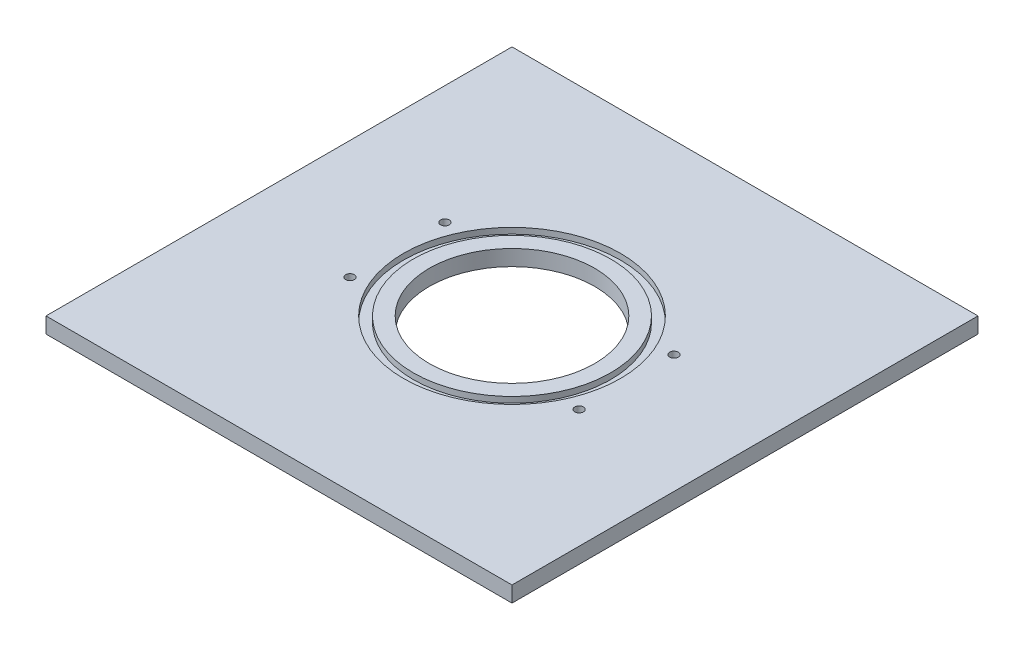
ISO-10303-21;
HEADER;
FILE_DESCRIPTION(('STEP AP214'),'2;1');
FILE_NAME('part.step','',(''),(''),'','','');
FILE_SCHEMA(('AUTOMOTIVE_DESIGN { 1 0 10303 214 1 1 1 1 }'));
ENDSEC;
DATA;
#1=APPLICATION_CONTEXT('core data for automotive mechanical design processes');
#2=APPLICATION_PROTOCOL_DEFINITION('international standard','automotive_design',2000,#1);
#3=PRODUCT_CONTEXT('',#1,'mechanical');
#4=PRODUCT('Part','Part','',(#3));
#5=PRODUCT_RELATED_PRODUCT_CATEGORY('part','',(#4));
#6=PRODUCT_DEFINITION_FORMATION('','',#4);
#7=PRODUCT_DEFINITION_CONTEXT('part definition',#1,'design');
#8=PRODUCT_DEFINITION('design','',#6,#7);
#9=PRODUCT_DEFINITION_SHAPE('','',#8);
#10=(LENGTH_UNIT() NAMED_UNIT(*) SI_UNIT(.MILLI.,.METRE.));
#11=(NAMED_UNIT(*) PLANE_ANGLE_UNIT() SI_UNIT($,.RADIAN.));
#12=(NAMED_UNIT(*) SI_UNIT($,.STERADIAN.) SOLID_ANGLE_UNIT());
#13=UNCERTAINTY_MEASURE_WITH_UNIT(LENGTH_MEASURE(1.E-05),#10,'distance_accuracy_value','');
#14=(GEOMETRIC_REPRESENTATION_CONTEXT(3) GLOBAL_UNCERTAINTY_ASSIGNED_CONTEXT((#13)) GLOBAL_UNIT_ASSIGNED_CONTEXT((#10,
#11,#12)) REPRESENTATION_CONTEXT('',''));
#15=CARTESIAN_POINT('',(0.,0.,0.));
#16=DIRECTION('',(0.,0.,1.));
#17=DIRECTION('',(1.,0.,0.));
#18=AXIS2_PLACEMENT_3D('',#15,#16,#17);
#19=CARTESIAN_POINT('',(0.,7.62,0.));
#20=DIRECTION('',(0.,1.,0.));
#21=DIRECTION('',(0.,0.,1.));
#22=AXIS2_PLACEMENT_3D('',#19,#20,#21);
#23=PLANE('',#22);
#24=CARTESIAN_POINT('',(0.,7.62,0.));
#25=DIRECTION('',(0.,1.,0.));
#26=DIRECTION('',(0.,0.,1.));
#27=AXIS2_PLACEMENT_3D('',#24,#25,#26);
#28=CIRCLE('',#27,40.);
#29=CARTESIAN_POINT('',(0.,7.62,-40.));
#30=VERTEX_POINT('',#29);
#31=EDGE_CURVE('E112',#30,#30,#28,.T.);
#32=ORIENTED_EDGE('',*,*,#31,.F.);
#33=EDGE_LOOP('',(#32));
#34=FACE_BOUND('',#33,.T.);
#35=CARTESIAN_POINT('',(0.,7.62,0.));
#36=DIRECTION('',(0.,1.,0.));
#37=DIRECTION('',(0.,0.,1.));
#38=AXIS2_PLACEMENT_3D('',#35,#36,#37);
#39=CIRCLE('',#38,47.7502);
#40=CARTESIAN_POINT('',(0.,7.62,47.7502));
#41=VERTEX_POINT('',#40);
#42=EDGE_CURVE('E129',#41,#41,#39,.T.);
#43=ORIENTED_EDGE('',*,*,#42,.T.);
#44=EDGE_LOOP('',(#43));
#45=FACE_BOUND('',#44,.T.);
#46=ADVANCED_FACE('F44',(#34,#45),#23,.T.);
#47=CARTESIAN_POINT('',(112.776,7.62,0.));
#48=DIRECTION('',(1.,0.,0.));
#49=DIRECTION('',(0.,0.,-1.));
#50=AXIS2_PLACEMENT_3D('',#47,#48,#49);
#51=PLANE('',#50);
#52=DIRECTION('',(0.,0.,1.));
#53=VECTOR('',#52,1.);
#54=CARTESIAN_POINT('',(112.776,0.,0.));
#55=LINE('',#54,#53);
#56=CARTESIAN_POINT('',(112.776,0.,-112.776));
#57=VERTEX_POINT('',#56);
#58=CARTESIAN_POINT('',(112.776,0.,112.776));
#59=VERTEX_POINT('',#58);
#60=EDGE_CURVE('E115',#57,#59,#55,.T.);
#61=ORIENTED_EDGE('',*,*,#60,.F.);
#62=DIRECTION('',(0.,-1.,0.));
#63=VECTOR('',#62,1.);
#64=CARTESIAN_POINT('',(112.776,7.62,-112.776));
#65=LINE('',#64,#63);
#66=CARTESIAN_POINT('',(112.776,7.62,-112.776));
#67=VERTEX_POINT('',#66);
#68=EDGE_CURVE('E12',#67,#57,#65,.T.);
#69=ORIENTED_EDGE('',*,*,#68,.F.);
#70=DIRECTION('',(0.,0.,1.));
#71=VECTOR('',#70,1.);
#72=CARTESIAN_POINT('',(112.776,7.62,0.));
#73=LINE('',#72,#71);
#74=CARTESIAN_POINT('',(112.776,7.62,112.776));
#75=VERTEX_POINT('',#74);
#76=EDGE_CURVE('E105',#67,#75,#73,.T.);
#77=ORIENTED_EDGE('',*,*,#76,.T.);
#78=DIRECTION('',(0.,-1.,0.));
#79=VECTOR('',#78,1.);
#80=CARTESIAN_POINT('',(112.776,7.62,112.776));
#81=LINE('',#80,#79);
#82=EDGE_CURVE('E85',#75,#59,#81,.T.);
#83=ORIENTED_EDGE('',*,*,#82,.T.);
#84=EDGE_LOOP('',(#61,#69,#77,#83));
#85=FACE_BOUND('',#84,.T.);
#86=ADVANCED_FACE('F46',(#85),#51,.T.);
#87=CARTESIAN_POINT('',(0.,7.62,-112.776));
#88=DIRECTION('',(0.,0.,-1.));
#89=DIRECTION('',(-1.,0.,0.));
#90=AXIS2_PLACEMENT_3D('',#87,#88,#89);
#91=PLANE('',#90);
#92=DIRECTION('',(1.,0.,0.));
#93=VECTOR('',#92,1.);
#94=CARTESIAN_POINT('',(0.,0.,-112.776));
#95=LINE('',#94,#93);
#96=CARTESIAN_POINT('',(-112.776,0.,-112.776));
#97=VERTEX_POINT('',#96);
#98=EDGE_CURVE('E98',#97,#57,#95,.T.);
#99=ORIENTED_EDGE('',*,*,#98,.F.);
#100=DIRECTION('',(0.,-1.,0.));
#101=VECTOR('',#100,1.);
#102=CARTESIAN_POINT('',(-112.776,7.62,-112.776));
#103=LINE('',#102,#101);
#104=CARTESIAN_POINT('',(-112.776,7.62,-112.776));
#105=VERTEX_POINT('',#104);
#106=EDGE_CURVE('E54',#105,#97,#103,.T.);
#107=ORIENTED_EDGE('',*,*,#106,.F.);
#108=DIRECTION('',(1.,0.,0.));
#109=VECTOR('',#108,1.);
#110=CARTESIAN_POINT('',(0.,7.62,-112.776));
#111=LINE('',#110,#109);
#112=EDGE_CURVE('E96',#105,#67,#111,.T.);
#113=ORIENTED_EDGE('',*,*,#112,.T.);
#114=ORIENTED_EDGE('',*,*,#68,.T.);
#115=EDGE_LOOP('',(#99,#107,#113,#114));
#116=FACE_BOUND('',#115,.T.);
#117=ADVANCED_FACE('F94',(#116),#91,.T.);
#118=CARTESIAN_POINT('',(-112.776,7.62,0.));
#119=DIRECTION('',(1.,0.,0.));
#120=DIRECTION('',(0.,0.,-1.));
#121=AXIS2_PLACEMENT_3D('',#118,#119,#120);
#122=PLANE('',#121);
#123=DIRECTION('',(0.,0.,1.));
#124=VECTOR('',#123,1.);
#125=CARTESIAN_POINT('',(-112.776,0.,0.));
#126=LINE('',#125,#124);
#127=CARTESIAN_POINT('',(-112.776,0.,112.776));
#128=VERTEX_POINT('',#127);
#129=EDGE_CURVE('E78',#97,#128,#126,.T.);
#130=ORIENTED_EDGE('',*,*,#129,.T.);
#131=DIRECTION('',(0.,-1.,0.));
#132=VECTOR('',#131,1.);
#133=CARTESIAN_POINT('',(-112.776,7.62,112.776));
#134=LINE('',#133,#132);
#135=CARTESIAN_POINT('',(-112.776,7.62,112.776));
#136=VERTEX_POINT('',#135);
#137=EDGE_CURVE('E99',#136,#128,#134,.T.);
#138=ORIENTED_EDGE('',*,*,#137,.F.);
#139=DIRECTION('',(0.,0.,1.));
#140=VECTOR('',#139,1.);
#141=CARTESIAN_POINT('',(-112.776,7.62,0.));
#142=LINE('',#141,#140);
#143=EDGE_CURVE('E101',#105,#136,#142,.T.);
#144=ORIENTED_EDGE('',*,*,#143,.F.);
#145=ORIENTED_EDGE('',*,*,#106,.T.);
#146=EDGE_LOOP('',(#130,#138,#144,#145));
#147=FACE_BOUND('',#146,.T.);
#148=ADVANCED_FACE('F102',(#147),#122,.F.);
#149=CARTESIAN_POINT('',(0.,7.62,112.776));
#150=DIRECTION('',(0.,0.,-1.));
#151=DIRECTION('',(-1.,0.,0.));
#152=AXIS2_PLACEMENT_3D('',#149,#150,#151);
#153=PLANE('',#152);
#154=DIRECTION('',(1.,0.,0.));
#155=VECTOR('',#154,1.);
#156=CARTESIAN_POINT('',(0.,0.,112.776));
#157=LINE('',#156,#155);
#158=EDGE_CURVE('E121',#128,#59,#157,.T.);
#159=ORIENTED_EDGE('',*,*,#158,.T.);
#160=ORIENTED_EDGE('',*,*,#82,.F.);
#161=DIRECTION('',(1.,0.,0.));
#162=VECTOR('',#161,1.);
#163=CARTESIAN_POINT('',(0.,7.62,112.776));
#164=LINE('',#163,#162);
#165=EDGE_CURVE('E63',#136,#75,#164,.T.);
#166=ORIENTED_EDGE('',*,*,#165,.F.);
#167=ORIENTED_EDGE('',*,*,#137,.T.);
#168=EDGE_LOOP('',(#159,#160,#166,#167));
#169=FACE_BOUND('',#168,.T.);
#170=ADVANCED_FACE('F170',(#169),#153,.F.);
#171=CARTESIAN_POINT('',(0.,7.62,0.));
#172=DIRECTION('',(0.,-1.,0.));
#173=DIRECTION('',(0.,0.,-1.));
#174=AXIS2_PLACEMENT_3D('',#171,#172,#173);
#175=CYLINDRICAL_SURFACE('',#174,40.);
#176=CARTESIAN_POINT('',(0.,0.,0.));
#177=DIRECTION('',(0.,1.,0.));
#178=DIRECTION('',(0.,0.,1.));
#179=AXIS2_PLACEMENT_3D('',#176,#177,#178);
#180=CIRCLE('',#179,40.);
#181=CARTESIAN_POINT('',(0.,0.,-40.));
#182=VERTEX_POINT('',#181);
#183=EDGE_CURVE('E107',#182,#182,#180,.T.);
#184=CARTESIAN_POINT('',(0.,7.62,-40.));
#185=CARTESIAN_POINT('',(0.,7.540625,-40.));
#186=CARTESIAN_POINT('',(0.,7.46125,-40.));
#187=CARTESIAN_POINT('',(0.,7.3025,-40.));
#188=CARTESIAN_POINT('',(0.,7.223125,-40.));
#189=CARTESIAN_POINT('',(0.,7.064375,-40.));
#190=CARTESIAN_POINT('',(0.,6.985,-40.));
#191=CARTESIAN_POINT('',(0.,6.82625,-40.));
#192=CARTESIAN_POINT('',(0.,6.746875,-40.));
#193=CARTESIAN_POINT('',(0.,6.588125,-40.));
#194=CARTESIAN_POINT('',(0.,6.50875,-40.));
#195=CARTESIAN_POINT('',(0.,6.35,-40.));
#196=CARTESIAN_POINT('',(0.,6.270625,-40.));
#197=CARTESIAN_POINT('',(0.,6.111875,-40.));
#198=CARTESIAN_POINT('',(0.,6.0325,-40.));
#199=CARTESIAN_POINT('',(0.,5.87375,-40.));
#200=CARTESIAN_POINT('',(0.,5.794375,-40.));
#201=CARTESIAN_POINT('',(0.,5.635625,-40.));
#202=CARTESIAN_POINT('',(0.,5.55625,-40.));
#203=CARTESIAN_POINT('',(0.,5.3975,-40.));
#204=CARTESIAN_POINT('',(0.,5.318125,-40.));
#205=CARTESIAN_POINT('',(0.,5.159375,-40.));
#206=CARTESIAN_POINT('',(0.,5.08,-40.));
#207=CARTESIAN_POINT('',(0.,4.92125,-40.));
#208=CARTESIAN_POINT('',(0.,4.841875,-40.));
#209=CARTESIAN_POINT('',(0.,4.683125,-40.));
#210=CARTESIAN_POINT('',(0.,4.60375,-40.));
#211=CARTESIAN_POINT('',(0.,4.445,-40.));
#212=CARTESIAN_POINT('',(0.,4.365625,-40.));
#213=CARTESIAN_POINT('',(0.,4.206875,-40.));
#214=CARTESIAN_POINT('',(0.,4.1275,-40.));
#215=CARTESIAN_POINT('',(0.,3.96875,-40.));
#216=CARTESIAN_POINT('',(0.,3.889375,-40.));
#217=CARTESIAN_POINT('',(0.,3.730625,-40.));
#218=CARTESIAN_POINT('',(0.,3.65125,-40.));
#219=CARTESIAN_POINT('',(0.,3.4925,-40.));
#220=CARTESIAN_POINT('',(0.,3.413125,-40.));
#221=CARTESIAN_POINT('',(0.,3.254375,-40.));
#222=CARTESIAN_POINT('',(0.,3.175,-40.));
#223=CARTESIAN_POINT('',(0.,3.01625,-40.));
#224=CARTESIAN_POINT('',(0.,2.936875,-40.));
#225=CARTESIAN_POINT('',(0.,2.778125,-40.));
#226=CARTESIAN_POINT('',(0.,2.69875,-40.));
#227=CARTESIAN_POINT('',(0.,2.54,-40.));
#228=CARTESIAN_POINT('',(0.,2.460625,-40.));
#229=CARTESIAN_POINT('',(0.,2.301875,-40.));
#230=CARTESIAN_POINT('',(0.,2.2225,-40.));
#231=CARTESIAN_POINT('',(0.,2.06375,-40.));
#232=CARTESIAN_POINT('',(0.,1.984375,-40.));
#233=CARTESIAN_POINT('',(0.,1.825625,-40.));
#234=CARTESIAN_POINT('',(0.,1.74625,-40.));
#235=CARTESIAN_POINT('',(0.,1.5875,-40.));
#236=CARTESIAN_POINT('',(0.,1.508125,-40.));
#237=CARTESIAN_POINT('',(0.,1.349375,-40.));
#238=CARTESIAN_POINT('',(0.,1.27,-40.));
#239=CARTESIAN_POINT('',(0.,1.11125,-40.));
#240=CARTESIAN_POINT('',(0.,1.031875,-40.));
#241=CARTESIAN_POINT('',(0.,0.873125,-40.));
#242=CARTESIAN_POINT('',(0.,0.79375,-40.));
#243=CARTESIAN_POINT('',(0.,0.635,-40.));
#244=CARTESIAN_POINT('',(0.,0.555625,-40.));
#245=CARTESIAN_POINT('',(0.,0.396875,-40.));
#246=CARTESIAN_POINT('',(0.,0.3175,-40.));
#247=CARTESIAN_POINT('',(0.,0.15875,-40.));
#248=CARTESIAN_POINT('',(0.,0.0793749999999999,-40.));
#249=CARTESIAN_POINT('',(0.,0.,-40.));
#250=B_SPLINE_CURVE_WITH_KNOTS('',3,(#184,#185,#186,#187,#188,#189,#190,#191,#192,#193,#194,
#195,#196,#197,#198,#199,#200,#201,#202,#203,#204,#205,#206,#207,#208,#209,#210,#211,#212,#213,
#214,#215,#216,#217,#218,#219,#220,#221,#222,#223,#224,#225,#226,#227,#228,#229,#230,#231,#232,
#233,#234,#235,#236,#237,#238,#239,#240,#241,#242,#243,#244,#245,#246,#247,#248,#249),
.UNSPECIFIED.,.F.,.F.,(4,2,2,2,2,2,2,2,2,2,2,2,2,2,2,2,2,2,2,2,2,2,2,2,2,2,2,2,2,2,2,2,4),(0.,
0.238125,0.47625,0.714375000000001,0.9525,1.190625,1.42875,1.666875,1.905,2.143125,2.38125,
2.619375,2.8575,3.095625,3.33375,3.571875,3.81,4.048125,4.28625,4.524375,4.7625,5.000625,
5.23875,5.476875,5.715,5.953125,6.19125,6.429375,6.6675,6.905625,7.14375,7.381875,7.62),.UNSPECIFIED.);
#251=EDGE_CURVE('BSEAM161',#30,#182,#250,.T.);
#252=ORIENTED_EDGE('',*,*,#31,.T.);
#253=ORIENTED_EDGE('',*,*,#183,.F.);
#254=ORIENTED_EDGE('',*,*,#251,.T.);
#255=ORIENTED_EDGE('',*,*,#251,.F.);
#256=EDGE_LOOP('',(#252,#254,#253,#255));
#257=FACE_BOUND('',#256,.T.);
#258=ADVANCED_FACE('F161',(#257),#175,.F.);
#259=CARTESIAN_POINT('',(55.4327719506775,7.62,22.9610059419047));
#260=DIRECTION('',(0.,1.,0.));
#261=DIRECTION('',(0.,0.,1.));
#262=AXIS2_PLACEMENT_3D('',#259,#260,#261);
#263=CIRCLE('',#262,2.09999999999999);
#264=CARTESIAN_POINT('',(55.4327719506775,7.62,25.0610059419047));
#265=VERTEX_POINT('',#264);
#266=EDGE_CURVE('E354',#265,#265,#263,.T.);
#267=ORIENTED_EDGE('',*,*,#266,.F.);
#268=EDGE_LOOP('',(#267));
#269=FACE_BOUND('',#268,.T.);
#270=CARTESIAN_POINT('',(-55.4327719506772,7.62,22.9610059419054));
#271=DIRECTION('',(0.,1.,0.));
#272=DIRECTION('',(0.,0.,1.));
#273=AXIS2_PLACEMENT_3D('',#270,#271,#272);
#274=CIRCLE('',#273,2.09999999999999);
#275=CARTESIAN_POINT('',(-55.4327719506772,7.62,25.0610059419054));
#276=VERTEX_POINT('',#275);
#277=EDGE_CURVE('E143',#276,#276,#274,.T.);
#278=ORIENTED_EDGE('',*,*,#277,.F.);
#279=EDGE_LOOP('',(#278));
#280=FACE_BOUND('',#279,.T.);
#281=CARTESIAN_POINT('',(-55.4327719506773,7.62,-22.9610059419051));
#282=DIRECTION('',(0.,1.,0.));
#283=DIRECTION('',(0.,0.,1.));
#284=AXIS2_PLACEMENT_3D('',#281,#282,#283);
#285=CIRCLE('',#284,2.09999999999999);
#286=CARTESIAN_POINT('',(-55.4327719506773,7.62,-20.8610059419051));
#287=VERTEX_POINT('',#286);
#288=EDGE_CURVE('E133',#287,#287,#285,.T.);
#289=ORIENTED_EDGE('',*,*,#288,.F.);
#290=EDGE_LOOP('',(#289));
#291=FACE_BOUND('',#290,.T.);
#292=CARTESIAN_POINT('',(55.4327719506772,7.62,-22.9610059419054));
#293=DIRECTION('',(0.,1.,0.));
#294=DIRECTION('',(0.,0.,1.));
#295=AXIS2_PLACEMENT_3D('',#292,#293,#294);
#296=CIRCLE('',#295,2.09999999999999);
#297=CARTESIAN_POINT('',(55.4327719506772,7.62,-20.8610059419054));
#298=VERTEX_POINT('',#297);
#299=EDGE_CURVE('E130',#298,#298,#296,.T.);
#300=ORIENTED_EDGE('',*,*,#299,.F.);
#301=EDGE_LOOP('',(#300));
#302=FACE_BOUND('',#301,.T.);
#303=CARTESIAN_POINT('',(0.,7.62,0.));
#304=DIRECTION('',(0.,1.,0.));
#305=DIRECTION('',(0.,0.,1.));
#306=AXIS2_PLACEMENT_3D('',#303,#304,#305);
#307=CIRCLE('',#306,52.5);
#308=CARTESIAN_POINT('',(0.,7.62,52.5));
#309=VERTEX_POINT('',#308);
#310=EDGE_CURVE('E150',#309,#309,#307,.T.);
#311=ORIENTED_EDGE('',*,*,#310,.F.);
#312=EDGE_LOOP('',(#311));
#313=FACE_BOUND('',#312,.T.);
#314=ORIENTED_EDGE('',*,*,#76,.F.);
#315=ORIENTED_EDGE('',*,*,#112,.F.);
#316=ORIENTED_EDGE('',*,*,#143,.T.);
#317=ORIENTED_EDGE('',*,*,#165,.T.);
#318=EDGE_LOOP('',(#314,#315,#316,#317));
#319=FACE_BOUND('',#318,.T.);
#320=ADVANCED_FACE('F104',(#269,#280,#291,#302,#313,#319),#23,.T.);
#321=CARTESIAN_POINT('',(0.,0.,0.));
#322=DIRECTION('',(0.,1.,0.));
#323=DIRECTION('',(0.,0.,1.));
#324=AXIS2_PLACEMENT_3D('',#321,#322,#323);
#325=PLANE('',#324);
#326=CARTESIAN_POINT('',(55.4327719506775,0.,22.9610059419047));
#327=DIRECTION('',(0.,1.,0.));
#328=DIRECTION('',(0.,0.,1.));
#329=AXIS2_PLACEMENT_3D('',#326,#327,#328);
#330=CIRCLE('',#329,2.09999999999999);
#331=CARTESIAN_POINT('',(55.4327719506775,0.,25.0610059419047));
#332=VERTEX_POINT('',#331);
#333=EDGE_CURVE('E357',#332,#332,#330,.T.);
#334=ORIENTED_EDGE('',*,*,#333,.T.);
#335=EDGE_LOOP('',(#334));
#336=FACE_BOUND('',#335,.T.);
#337=CARTESIAN_POINT('',(-55.4327719506772,0.,22.9610059419054));
#338=DIRECTION('',(0.,1.,0.));
#339=DIRECTION('',(0.,0.,1.));
#340=AXIS2_PLACEMENT_3D('',#337,#338,#339);
#341=CIRCLE('',#340,2.09999999999999);
#342=CARTESIAN_POINT('',(-55.4327719506772,0.,25.0610059419054));
#343=VERTEX_POINT('',#342);
#344=EDGE_CURVE('E48',#343,#343,#341,.T.);
#345=ORIENTED_EDGE('',*,*,#344,.T.);
#346=EDGE_LOOP('',(#345));
#347=FACE_BOUND('',#346,.T.);
#348=CARTESIAN_POINT('',(-55.4327719506773,0.,-22.9610059419051));
#349=DIRECTION('',(0.,1.,0.));
#350=DIRECTION('',(0.,0.,1.));
#351=AXIS2_PLACEMENT_3D('',#348,#349,#350);
#352=CIRCLE('',#351,2.09999999999999);
#353=CARTESIAN_POINT('',(-55.4327719506773,0.,-20.8610059419051));
#354=VERTEX_POINT('',#353);
#355=EDGE_CURVE('E131',#354,#354,#352,.T.);
#356=ORIENTED_EDGE('',*,*,#355,.T.);
#357=EDGE_LOOP('',(#356));
#358=FACE_BOUND('',#357,.T.);
#359=CARTESIAN_POINT('',(55.4327719506772,0.,-22.9610059419054));
#360=DIRECTION('',(0.,1.,0.));
#361=DIRECTION('',(0.,0.,1.));
#362=AXIS2_PLACEMENT_3D('',#359,#360,#361);
#363=CIRCLE('',#362,2.09999999999999);
#364=CARTESIAN_POINT('',(55.4327719506772,0.,-20.8610059419054));
#365=VERTEX_POINT('',#364);
#366=EDGE_CURVE('E127',#365,#365,#363,.T.);
#367=ORIENTED_EDGE('',*,*,#366,.T.);
#368=EDGE_LOOP('',(#367));
#369=FACE_BOUND('',#368,.T.);
#370=ORIENTED_EDGE('',*,*,#60,.T.);
#371=ORIENTED_EDGE('',*,*,#158,.F.);
#372=ORIENTED_EDGE('',*,*,#129,.F.);
#373=ORIENTED_EDGE('',*,*,#98,.T.);
#374=EDGE_LOOP('',(#370,#371,#372,#373));
#375=FACE_BOUND('',#374,.T.);
#376=ORIENTED_EDGE('',*,*,#183,.T.);
#377=EDGE_LOOP('',(#376));
#378=FACE_BOUND('',#377,.T.);
#379=ADVANCED_FACE('F160',(#336,#347,#358,#369,#375,#378),#325,.F.);
#380=CARTESIAN_POINT('',(0.,4.7752,0.));
#381=DIRECTION('',(0.,1.,0.));
#382=DIRECTION('',(0.,0.,1.));
#383=AXIS2_PLACEMENT_3D('',#380,#381,#382);
#384=CYLINDRICAL_SURFACE('',#383,52.5);
#385=CARTESIAN_POINT('',(0.,4.7752,0.));
#386=DIRECTION('',(0.,1.,0.));
#387=DIRECTION('',(0.,0.,1.));
#388=AXIS2_PLACEMENT_3D('',#385,#386,#387);
#389=CIRCLE('',#388,52.5);
#390=CARTESIAN_POINT('',(0.,4.7752,52.5));
#391=VERTEX_POINT('',#390);
#392=EDGE_CURVE('E118',#391,#391,#389,.T.);
#393=ORIENTED_EDGE('',*,*,#392,.F.);
#394=EDGE_LOOP('',(#393));
#395=FACE_BOUND('',#394,.T.);
#396=ORIENTED_EDGE('',*,*,#310,.T.);
#397=EDGE_LOOP('',(#396));
#398=FACE_BOUND('',#397,.T.);
#399=ADVANCED_FACE('F157',(#395,#398),#384,.F.);
#400=CARTESIAN_POINT('',(0.,4.7752,0.));
#401=DIRECTION('',(0.,1.,0.));
#402=DIRECTION('',(0.,0.,1.));
#403=AXIS2_PLACEMENT_3D('',#400,#401,#402);
#404=PLANE('',#403);
#405=CARTESIAN_POINT('',(0.,4.7752,0.));
#406=DIRECTION('',(0.,1.,0.));
#407=DIRECTION('',(0.,0.,1.));
#408=AXIS2_PLACEMENT_3D('',#405,#406,#407);
#409=CIRCLE('',#408,47.7502);
#410=CARTESIAN_POINT('',(0.,4.7752,47.7502));
#411=VERTEX_POINT('',#410);
#412=EDGE_CURVE('E147',#411,#411,#409,.T.);
#413=ORIENTED_EDGE('',*,*,#412,.F.);
#414=EDGE_LOOP('',(#413));
#415=FACE_BOUND('',#414,.T.);
#416=ORIENTED_EDGE('',*,*,#392,.T.);
#417=EDGE_LOOP('',(#416));
#418=FACE_BOUND('',#417,.T.);
#419=ADVANCED_FACE('F188',(#415,#418),#404,.T.);
#420=CARTESIAN_POINT('',(0.,4.7752,0.));
#421=DIRECTION('',(0.,1.,0.));
#422=DIRECTION('',(0.,0.,1.));
#423=AXIS2_PLACEMENT_3D('',#420,#421,#422);
#424=CYLINDRICAL_SURFACE('',#423,47.7502);
#425=ORIENTED_EDGE('',*,*,#412,.T.);
#426=EDGE_LOOP('',(#425));
#427=FACE_BOUND('',#426,.T.);
#428=ORIENTED_EDGE('',*,*,#42,.F.);
#429=EDGE_LOOP('',(#428));
#430=FACE_BOUND('',#429,.T.);
#431=ADVANCED_FACE('F185',(#427,#430),#424,.T.);
#432=CARTESIAN_POINT('',(55.4327719506772,7.62,-22.9610059419054));
#433=DIRECTION('',(0.,1.,0.));
#434=DIRECTION('',(0.,0.,1.));
#435=AXIS2_PLACEMENT_3D('',#432,#433,#434);
#436=CYLINDRICAL_SURFACE('',#435,2.09999999999999);
#437=ORIENTED_EDGE('',*,*,#299,.T.);
#438=EDGE_LOOP('',(#437));
#439=FACE_BOUND('',#438,.T.);
#440=ORIENTED_EDGE('',*,*,#366,.F.);
#441=EDGE_LOOP('',(#440));
#442=FACE_BOUND('',#441,.T.);
#443=ADVANCED_FACE('F187',(#439,#442),#436,.F.);
#444=CARTESIAN_POINT('',(-55.4327719506773,7.62,-22.9610059419051));
#445=DIRECTION('',(0.,1.,0.));
#446=DIRECTION('',(0.,0.,1.));
#447=AXIS2_PLACEMENT_3D('',#444,#445,#446);
#448=CYLINDRICAL_SURFACE('',#447,2.09999999999999);
#449=ORIENTED_EDGE('',*,*,#288,.T.);
#450=EDGE_LOOP('',(#449));
#451=FACE_BOUND('',#450,.T.);
#452=ORIENTED_EDGE('',*,*,#355,.F.);
#453=EDGE_LOOP('',(#452));
#454=FACE_BOUND('',#453,.T.);
#455=ADVANCED_FACE('F195',(#451,#454),#448,.F.);
#456=CARTESIAN_POINT('',(-55.4327719506772,7.62,22.9610059419054));
#457=DIRECTION('',(0.,1.,0.));
#458=DIRECTION('',(0.,0.,1.));
#459=AXIS2_PLACEMENT_3D('',#456,#457,#458);
#460=CYLINDRICAL_SURFACE('',#459,2.09999999999999);
#461=ORIENTED_EDGE('',*,*,#277,.T.);
#462=EDGE_LOOP('',(#461));
#463=FACE_BOUND('',#462,.T.);
#464=ORIENTED_EDGE('',*,*,#344,.F.);
#465=EDGE_LOOP('',(#464));
#466=FACE_BOUND('',#465,.T.);
#467=ADVANCED_FACE('F251',(#463,#466),#460,.F.);
#468=CARTESIAN_POINT('',(55.4327719506775,7.62,22.9610059419047));
#469=DIRECTION('',(0.,1.,0.));
#470=DIRECTION('',(0.,0.,1.));
#471=AXIS2_PLACEMENT_3D('',#468,#469,#470);
#472=CYLINDRICAL_SURFACE('',#471,2.09999999999999);
#473=ORIENTED_EDGE('',*,*,#266,.T.);
#474=EDGE_LOOP('',(#473));
#475=FACE_BOUND('',#474,.T.);
#476=ORIENTED_EDGE('',*,*,#333,.F.);
#477=EDGE_LOOP('',(#476));
#478=FACE_BOUND('',#477,.T.);
#479=ADVANCED_FACE('F260',(#475,#478),#472,.F.);
#480=CLOSED_SHELL('',(#46,#86,#117,#148,#170,#258,#320,#379,#399,#419,#431,#443,#455,#467,#479));
#481=MANIFOLD_SOLID_BREP('B2',#480);
#482=ADVANCED_BREP_SHAPE_REPRESENTATION('',(#18,#481),#14);
#483=SHAPE_DEFINITION_REPRESENTATION(#9,#482);
ENDSEC;
END-ISO-10303-21;
